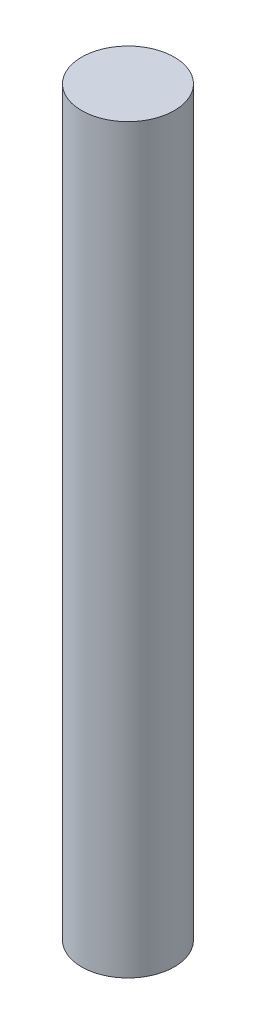
ISO-10303-21;
HEADER;
FILE_DESCRIPTION(('STEP AP214'),'2;1');
FILE_NAME('part.step','',(''),(''),'','','');
FILE_SCHEMA(('AUTOMOTIVE_DESIGN { 1 0 10303 214 1 1 1 1 }'));
ENDSEC;
DATA;
#1=APPLICATION_CONTEXT('core data for automotive mechanical design processes');
#2=APPLICATION_PROTOCOL_DEFINITION('international standard','automotive_design',2000,#1);
#3=PRODUCT_CONTEXT('',#1,'mechanical');
#4=PRODUCT('Part','Part','',(#3));
#5=PRODUCT_RELATED_PRODUCT_CATEGORY('part','',(#4));
#6=PRODUCT_DEFINITION_FORMATION('','',#4);
#7=PRODUCT_DEFINITION_CONTEXT('part definition',#1,'design');
#8=PRODUCT_DEFINITION('design','',#6,#7);
#9=PRODUCT_DEFINITION_SHAPE('','',#8);
#10=(LENGTH_UNIT() NAMED_UNIT(*) SI_UNIT(.MILLI.,.METRE.));
#11=(NAMED_UNIT(*) PLANE_ANGLE_UNIT() SI_UNIT($,.RADIAN.));
#12=(NAMED_UNIT(*) SI_UNIT($,.STERADIAN.) SOLID_ANGLE_UNIT());
#13=UNCERTAINTY_MEASURE_WITH_UNIT(LENGTH_MEASURE(1.E-05),#10,'distance_accuracy_value','');
#14=(GEOMETRIC_REPRESENTATION_CONTEXT(3) GLOBAL_UNCERTAINTY_ASSIGNED_CONTEXT((#13)) GLOBAL_UNIT_ASSIGNED_CONTEXT((#10,
#11,#12)) REPRESENTATION_CONTEXT('',''));
#15=CARTESIAN_POINT('',(0.,0.,0.));
#16=DIRECTION('',(0.,0.,1.));
#17=DIRECTION('',(1.,0.,0.));
#18=AXIS2_PLACEMENT_3D('',#15,#16,#17);
#19=CARTESIAN_POINT('',(0.,50.8,0.));
#20=DIRECTION('',(0.,-1.,0.));
#21=DIRECTION('',(0.,0.,-1.));
#22=AXIS2_PLACEMENT_3D('',#19,#20,#21);
#23=CYLINDRICAL_SURFACE('',#22,3.175);
#24=CARTESIAN_POINT('',(0.,50.8,0.));
#25=DIRECTION('',(0.,1.,0.));
#26=DIRECTION('',(0.,0.,1.));
#27=AXIS2_PLACEMENT_3D('',#24,#25,#26);
#28=CIRCLE('',#27,3.175);
#29=CARTESIAN_POINT('',(0.,50.8,3.175));
#30=VERTEX_POINT('',#29);
#31=EDGE_CURVE('E10',#30,#30,#28,.T.);
#32=ORIENTED_EDGE('',*,*,#31,.F.);
#33=EDGE_LOOP('',(#32));
#34=FACE_BOUND('',#33,.T.);
#35=CARTESIAN_POINT('',(0.,0.,0.));
#36=DIRECTION('',(0.,1.,0.));
#37=DIRECTION('',(0.,0.,1.));
#38=AXIS2_PLACEMENT_3D('',#35,#36,#37);
#39=CIRCLE('',#38,3.175);
#40=CARTESIAN_POINT('',(0.,0.,3.175));
#41=VERTEX_POINT('',#40);
#42=EDGE_CURVE('E33',#41,#41,#39,.T.);
#43=ORIENTED_EDGE('',*,*,#42,.T.);
#44=EDGE_LOOP('',(#43));
#45=FACE_BOUND('',#44,.T.);
#46=ADVANCED_FACE('F30',(#34,#45),#23,.T.);
#47=CARTESIAN_POINT('',(0.,50.8,0.));
#48=DIRECTION('',(0.,1.,0.));
#49=DIRECTION('',(0.,0.,1.));
#50=AXIS2_PLACEMENT_3D('',#47,#48,#49);
#51=PLANE('',#50);
#52=ORIENTED_EDGE('',*,*,#31,.T.);
#53=EDGE_LOOP('',(#52));
#54=FACE_BOUND('',#53,.T.);
#55=ADVANCED_FACE('F45',(#54),#51,.T.);
#56=CARTESIAN_POINT('',(0.,0.,0.));
#57=DIRECTION('',(0.,1.,0.));
#58=DIRECTION('',(0.,0.,1.));
#59=AXIS2_PLACEMENT_3D('',#56,#57,#58);
#60=PLANE('',#59);
#61=ORIENTED_EDGE('',*,*,#42,.F.);
#62=EDGE_LOOP('',(#61));
#63=FACE_BOUND('',#62,.T.);
#64=ADVANCED_FACE('F43',(#63),#60,.F.);
#65=CLOSED_SHELL('',(#46,#55,#64));
#66=MANIFOLD_SOLID_BREP('B2',#65);
#67=ADVANCED_BREP_SHAPE_REPRESENTATION('',(#18,#66),#14);
#68=SHAPE_DEFINITION_REPRESENTATION(#9,#67);
ENDSEC;
END-ISO-10303-21;
